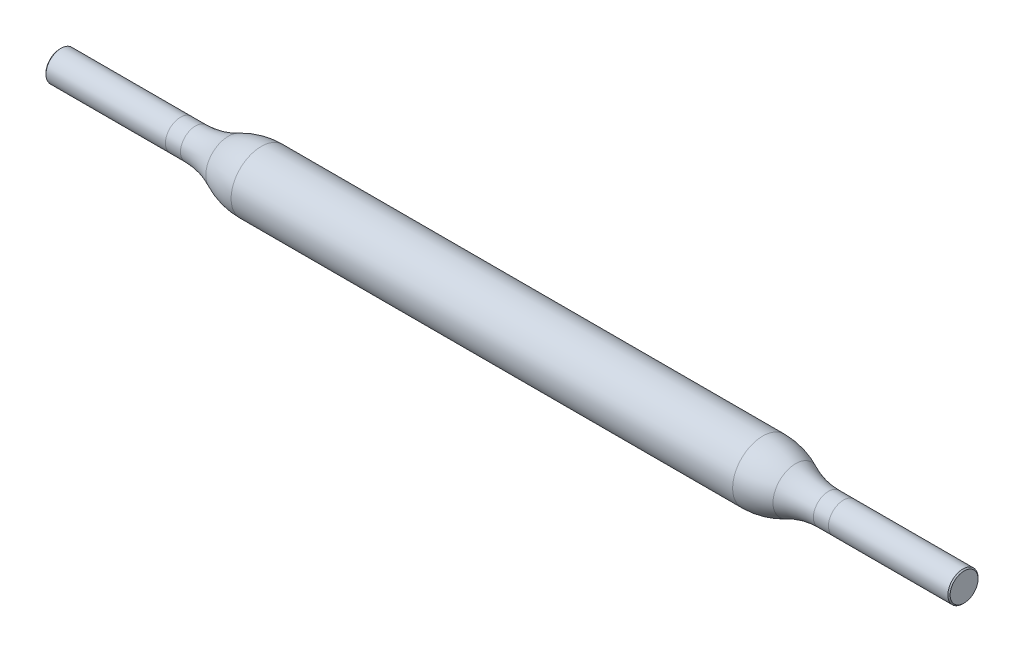
ISO-10303-21;
HEADER;
FILE_DESCRIPTION(('STEP AP214'),'2;1');
FILE_NAME('part.step','',(''),(''),'','','');
FILE_SCHEMA(('AUTOMOTIVE_DESIGN { 1 0 10303 214 1 1 1 1 }'));
ENDSEC;
DATA;
#1=APPLICATION_CONTEXT('core data for automotive mechanical design processes');
#2=APPLICATION_PROTOCOL_DEFINITION('international standard','automotive_design',2000,#1);
#3=PRODUCT_CONTEXT('',#1,'mechanical');
#4=PRODUCT('Part','Part','',(#3));
#5=PRODUCT_RELATED_PRODUCT_CATEGORY('part','',(#4));
#6=PRODUCT_DEFINITION_FORMATION('','',#4);
#7=PRODUCT_DEFINITION_CONTEXT('part definition',#1,'design');
#8=PRODUCT_DEFINITION('design','',#6,#7);
#9=PRODUCT_DEFINITION_SHAPE('','',#8);
#10=(LENGTH_UNIT() NAMED_UNIT(*) SI_UNIT(.MILLI.,.METRE.));
#11=(NAMED_UNIT(*) PLANE_ANGLE_UNIT() SI_UNIT($,.RADIAN.));
#12=(NAMED_UNIT(*) SI_UNIT($,.STERADIAN.) SOLID_ANGLE_UNIT());
#13=UNCERTAINTY_MEASURE_WITH_UNIT(LENGTH_MEASURE(1.E-05),#10,'distance_accuracy_value','');
#14=(GEOMETRIC_REPRESENTATION_CONTEXT(3) GLOBAL_UNCERTAINTY_ASSIGNED_CONTEXT((#13)) GLOBAL_UNIT_ASSIGNED_CONTEXT((#10,
#11,#12)) REPRESENTATION_CONTEXT('',''));
#15=CARTESIAN_POINT('',(0.,0.,0.));
#16=DIRECTION('',(0.,0.,1.));
#17=DIRECTION('',(1.,0.,0.));
#18=AXIS2_PLACEMENT_3D('',#15,#16,#17);
#19=CARTESIAN_POINT('',(-30.,-3.05202241798517,0.));
#20=DIRECTION('',(-1.,0.,0.));
#21=DIRECTION('',(0.,0.,1.));
#22=AXIS2_PLACEMENT_3D('',#19,#20,#21);
#23=CYLINDRICAL_SURFACE('',#22,0.999999999999999);
#24=CARTESIAN_POINT('',(21.,-3.05202241798517,0.));
#25=DIRECTION('',(-1.,0.,0.));
#26=DIRECTION('',(0.,0.,1.));
#27=AXIS2_PLACEMENT_3D('',#24,#25,#26);
#28=CIRCLE('',#27,0.999999999999999);
#29=CARTESIAN_POINT('',(21.,-3.05202241798517,0.999999999999999));
#30=VERTEX_POINT('',#29);
#31=EDGE_CURVE('E80',#30,#30,#28,.T.);
#32=ORIENTED_EDGE('',*,*,#31,.F.);
#33=EDGE_LOOP('',(#32));
#34=FACE_BOUND('',#33,.T.);
#35=CARTESIAN_POINT('',(22.,-3.05202241798517,0.));
#36=DIRECTION('',(1.,0.,0.));
#37=DIRECTION('',(0.,0.,-1.));
#38=AXIS2_PLACEMENT_3D('',#35,#36,#37);
#39=CIRCLE('',#38,0.999999999999999);
#40=CARTESIAN_POINT('',(22.,-3.05202241798517,-0.999999999999999));
#41=VERTEX_POINT('',#40);
#42=EDGE_CURVE('E72',#41,#41,#39,.T.);
#43=ORIENTED_EDGE('',*,*,#42,.F.);
#44=EDGE_LOOP('',(#43));
#45=FACE_BOUND('',#44,.T.);
#46=ADVANCED_FACE('F47',(#34,#45),#23,.T.);
#47=CARTESIAN_POINT('',(-30.,-3.05202241798517,0.));
#48=DIRECTION('',(-1.,0.,0.));
#49=DIRECTION('',(0.,0.,1.));
#50=AXIS2_PLACEMENT_3D('',#47,#48,#49);
#51=CYLINDRICAL_SURFACE('',#50,1.);
#52=CARTESIAN_POINT('',(-29.925,-3.05202241798517,0.));
#53=DIRECTION('',(1.,0.,0.));
#54=DIRECTION('',(0.,0.,-1.));
#55=AXIS2_PLACEMENT_3D('',#52,#53,#54);
#56=CIRCLE('',#55,1.);
#57=CARTESIAN_POINT('',(-29.925,-3.05202241798517,-1.));
#58=VERTEX_POINT('',#57);
#59=EDGE_CURVE('E61',#58,#58,#56,.T.);
#60=ORIENTED_EDGE('',*,*,#59,.T.);
#61=EDGE_LOOP('',(#60));
#62=FACE_BOUND('',#61,.T.);
#63=CARTESIAN_POINT('',(-22.,-3.05202241798517,0.));
#64=DIRECTION('',(1.,0.,0.));
#65=DIRECTION('',(0.,0.,-1.));
#66=AXIS2_PLACEMENT_3D('',#63,#64,#65);
#67=CIRCLE('',#66,1.);
#68=CARTESIAN_POINT('',(-22.,-3.05202241798517,-1.));
#69=VERTEX_POINT('',#68);
#70=EDGE_CURVE('E76',#69,#69,#67,.T.);
#71=ORIENTED_EDGE('',*,*,#70,.F.);
#72=EDGE_LOOP('',(#71));
#73=FACE_BOUND('',#72,.T.);
#74=ADVANCED_FACE('F140',(#62,#73),#51,.T.);
#75=CARTESIAN_POINT('',(-30.,-3.05202241798517,0.));
#76=DIRECTION('',(1.,0.,0.));
#77=DIRECTION('',(0.,0.,-1.));
#78=AXIS2_PLACEMENT_3D('',#75,#76,#77);
#79=PLANE('',#78);
#80=CARTESIAN_POINT('',(-30.,-3.05202241798517,0.));
#81=DIRECTION('',(1.,0.,0.));
#82=DIRECTION('',(0.,0.,-1.));
#83=AXIS2_PLACEMENT_3D('',#80,#81,#82);
#84=CIRCLE('',#83,0.924999999999995);
#85=CARTESIAN_POINT('',(-30.,-3.05202241798517,-0.924999999999995));
#86=VERTEX_POINT('',#85);
#87=EDGE_CURVE('E66',#86,#86,#84,.F.);
#88=ORIENTED_EDGE('',*,*,#87,.T.);
#89=EDGE_LOOP('',(#88));
#90=FACE_BOUND('',#89,.T.);
#91=ADVANCED_FACE('F149',(#90),#79,.F.);
#92=CARTESIAN_POINT('',(30.,-3.05202241798517,0.));
#93=DIRECTION('',(-1.,0.,0.));
#94=DIRECTION('',(0.,0.,1.));
#95=AXIS2_PLACEMENT_3D('',#92,#93,#94);
#96=PLANE('',#95);
#97=CARTESIAN_POINT('',(30.,-3.05202241798517,0.));
#98=DIRECTION('',(-1.,0.,0.));
#99=DIRECTION('',(0.,0.,1.));
#100=AXIS2_PLACEMENT_3D('',#97,#98,#99);
#101=CIRCLE('',#100,0.925000000000002);
#102=CARTESIAN_POINT('',(30.,-3.05202241798517,0.925000000000002));
#103=VERTEX_POINT('',#102);
#104=EDGE_CURVE('E10',#103,#103,#101,.F.);
#105=ORIENTED_EDGE('',*,*,#104,.T.);
#106=EDGE_LOOP('',(#105));
#107=FACE_BOUND('',#106,.T.);
#108=ADVANCED_FACE('F145',(#107),#96,.F.);
#109=CARTESIAN_POINT('',(29.925,-3.05202241798517,0.));
#110=DIRECTION('',(-1.,0.,0.));
#111=DIRECTION('',(0.,0.,1.));
#112=AXIS2_PLACEMENT_3D('',#109,#110,#111);
#113=CIRCLE('',#112,0.999999999999999);
#114=CARTESIAN_POINT('',(29.925,-3.05202241798517,0.999999999999999));
#115=VERTEX_POINT('',#114);
#116=EDGE_CURVE('E56',#115,#115,#113,.T.);
#117=ORIENTED_EDGE('',*,*,#116,.T.);
#118=EDGE_LOOP('',(#117));
#119=FACE_BOUND('',#118,.T.);
#120=ORIENTED_EDGE('',*,*,#42,.T.);
#121=EDGE_LOOP('',(#120));
#122=FACE_BOUND('',#121,.T.);
#123=ADVANCED_FACE('F134',(#119,#122),#23,.T.);
#124=CARTESIAN_POINT('',(21.,-3.05202241798517,0.));
#125=DIRECTION('',(-1.,0.,0.));
#126=DIRECTION('',(0.,0.,1.));
#127=AXIS2_PLACEMENT_3D('',#124,#125,#126);
#128=TOROIDAL_SURFACE('',#127,6.,5.);
#129=CARTESIAN_POINT('',(18.8205505282297,-3.05202241798517,0.));
#130=DIRECTION('',(-1.,0.,0.));
#131=DIRECTION('',(0.,0.,1.));
#132=AXIS2_PLACEMENT_3D('',#129,#130,#131);
#133=CIRCLE('',#132,1.5);
#134=CARTESIAN_POINT('',(18.8205505282297,-3.05202241798517,1.5));
#135=VERTEX_POINT('',#134);
#136=EDGE_CURVE('E84',#135,#135,#133,.T.);
#137=ORIENTED_EDGE('',*,*,#136,.F.);
#138=EDGE_LOOP('',(#137));
#139=FACE_BOUND('',#138,.T.);
#140=ORIENTED_EDGE('',*,*,#31,.T.);
#141=EDGE_LOOP('',(#140));
#142=FACE_BOUND('',#141,.T.);
#143=ADVANCED_FACE('F128',(#139,#142),#128,.F.);
#144=CARTESIAN_POINT('',(16.6411010564593,-3.05202241798517,0.));
#145=DIRECTION('',(-1.,0.,0.));
#146=DIRECTION('',(0.,0.,1.));
#147=AXIS2_PLACEMENT_3D('',#144,#145,#146);
#148=DEGENERATE_TOROIDAL_SURFACE('',#147,3.,5.,.F.);
#149=CARTESIAN_POINT('',(16.6411010564593,-3.05202241798517,0.));
#150=DIRECTION('',(-1.,0.,0.));
#151=DIRECTION('',(0.,0.,1.));
#152=AXIS2_PLACEMENT_3D('',#149,#150,#151);
#153=CIRCLE('',#152,2.);
#154=CARTESIAN_POINT('',(16.6411010564593,-3.05202241798517,2.));
#155=VERTEX_POINT('',#154);
#156=EDGE_CURVE('E88',#155,#155,#153,.T.);
#157=ORIENTED_EDGE('',*,*,#156,.F.);
#158=EDGE_LOOP('',(#157));
#159=FACE_BOUND('',#158,.T.);
#160=ORIENTED_EDGE('',*,*,#136,.T.);
#161=EDGE_LOOP('',(#160));
#162=FACE_BOUND('',#161,.T.);
#163=ADVANCED_FACE('F122',(#159,#162),#148,.F.);
#164=CARTESIAN_POINT('',(-30.,-3.05202241798517,0.));
#165=DIRECTION('',(-1.,0.,0.));
#166=DIRECTION('',(0.,0.,1.));
#167=AXIS2_PLACEMENT_3D('',#164,#165,#166);
#168=CYLINDRICAL_SURFACE('',#167,2.);
#169=CARTESIAN_POINT('',(-16.6411010564593,-3.05202241798517,0.));
#170=DIRECTION('',(-1.,0.,0.));
#171=DIRECTION('',(0.,0.,1.));
#172=AXIS2_PLACEMENT_3D('',#169,#170,#171);
#173=CIRCLE('',#172,2.);
#174=CARTESIAN_POINT('',(-16.6411010564593,-3.05202241798517,2.));
#175=VERTEX_POINT('',#174);
#176=EDGE_CURVE('E92',#175,#175,#173,.T.);
#177=ORIENTED_EDGE('',*,*,#176,.F.);
#178=EDGE_LOOP('',(#177));
#179=FACE_BOUND('',#178,.T.);
#180=ORIENTED_EDGE('',*,*,#156,.T.);
#181=EDGE_LOOP('',(#180));
#182=FACE_BOUND('',#181,.T.);
#183=ADVANCED_FACE('F116',(#179,#182),#168,.T.);
#184=CARTESIAN_POINT('',(-16.6411010564593,-3.05202241798517,0.));
#185=DIRECTION('',(-1.,0.,0.));
#186=DIRECTION('',(0.,0.,1.));
#187=AXIS2_PLACEMENT_3D('',#184,#185,#186);
#188=DEGENERATE_TOROIDAL_SURFACE('',#187,3.,5.,.F.);
#189=CARTESIAN_POINT('',(-18.8205505282297,-3.05202241798517,0.));
#190=DIRECTION('',(-1.,0.,0.));
#191=DIRECTION('',(0.,0.,1.));
#192=AXIS2_PLACEMENT_3D('',#189,#190,#191);
#193=CIRCLE('',#192,1.5);
#194=CARTESIAN_POINT('',(-18.8205505282297,-3.05202241798517,1.5));
#195=VERTEX_POINT('',#194);
#196=EDGE_CURVE('E96',#195,#195,#193,.T.);
#197=ORIENTED_EDGE('',*,*,#196,.F.);
#198=EDGE_LOOP('',(#197));
#199=FACE_BOUND('',#198,.T.);
#200=ORIENTED_EDGE('',*,*,#176,.T.);
#201=EDGE_LOOP('',(#200));
#202=FACE_BOUND('',#201,.T.);
#203=ADVANCED_FACE('F110',(#199,#202),#188,.F.);
#204=CARTESIAN_POINT('',(-21.,-3.05202241798517,0.));
#205=DIRECTION('',(-1.,0.,0.));
#206=DIRECTION('',(0.,0.,1.));
#207=AXIS2_PLACEMENT_3D('',#204,#205,#206);
#208=TOROIDAL_SURFACE('',#207,6.,5.);
#209=CARTESIAN_POINT('',(-21.,-3.05202241798517,0.));
#210=DIRECTION('',(-1.,0.,0.));
#211=DIRECTION('',(0.,0.,1.));
#212=AXIS2_PLACEMENT_3D('',#209,#210,#211);
#213=CIRCLE('',#212,1.);
#214=CARTESIAN_POINT('',(-21.,-3.05202241798517,1.));
#215=VERTEX_POINT('',#214);
#216=EDGE_CURVE('E100',#215,#215,#213,.T.);
#217=ORIENTED_EDGE('',*,*,#216,.F.);
#218=EDGE_LOOP('',(#217));
#219=FACE_BOUND('',#218,.T.);
#220=ORIENTED_EDGE('',*,*,#196,.T.);
#221=EDGE_LOOP('',(#220));
#222=FACE_BOUND('',#221,.T.);
#223=ADVANCED_FACE('F107',(#219,#222),#208,.F.);
#224=ORIENTED_EDGE('',*,*,#70,.T.);
#225=EDGE_LOOP('',(#224));
#226=FACE_BOUND('',#225,.T.);
#227=ORIENTED_EDGE('',*,*,#216,.T.);
#228=EDGE_LOOP('',(#227));
#229=FACE_BOUND('',#228,.T.);
#230=ADVANCED_FACE('F105',(#226,#229),#51,.T.);
#231=CARTESIAN_POINT('',(-30.,-3.05202241798517,0.));
#232=DIRECTION('',(1.,0.,0.));
#233=DIRECTION('',(0.,0.,-1.));
#234=AXIS2_PLACEMENT_3D('',#231,#232,#233);
#235=CONICAL_SURFACE('',#234,0.924999999999995,0.785398163397489);
#236=ORIENTED_EDGE('',*,*,#59,.F.);
#237=EDGE_LOOP('',(#236));
#238=FACE_BOUND('',#237,.T.);
#239=ORIENTED_EDGE('',*,*,#87,.F.);
#240=EDGE_LOOP('',(#239));
#241=FACE_BOUND('',#240,.T.);
#242=ADVANCED_FACE('F155',(#238,#241),#235,.T.);
#243=CARTESIAN_POINT('',(29.925,-3.05202241798517,0.));
#244=DIRECTION('',(-1.,0.,0.));
#245=DIRECTION('',(0.,0.,1.));
#246=AXIS2_PLACEMENT_3D('',#243,#244,#245);
#247=CONICAL_SURFACE('',#246,0.999999999999999,0.785398163397484);
#248=ORIENTED_EDGE('',*,*,#104,.F.);
#249=EDGE_LOOP('',(#248));
#250=FACE_BOUND('',#249,.T.);
#251=ORIENTED_EDGE('',*,*,#116,.F.);
#252=EDGE_LOOP('',(#251));
#253=FACE_BOUND('',#252,.T.);
#254=ADVANCED_FACE('F50',(#250,#253),#247,.T.);
#255=CLOSED_SHELL('',(#46,#74,#91,#108,#123,#143,#163,#183,#203,#223,#230,#242,#254));
#256=MANIFOLD_SOLID_BREP('B2',#255);
#257=ADVANCED_BREP_SHAPE_REPRESENTATION('',(#18,#256),#14);
#258=SHAPE_DEFINITION_REPRESENTATION(#9,#257);
ENDSEC;
END-ISO-10303-21;
